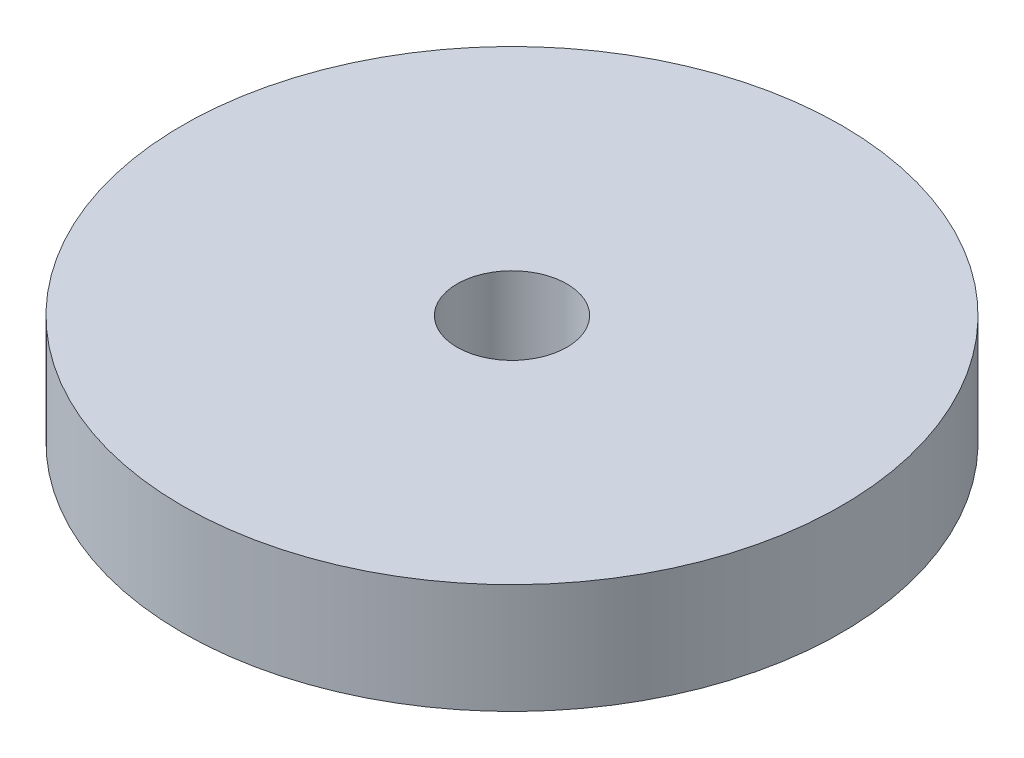
ISO-10303-21;
HEADER;
FILE_DESCRIPTION(('STEP AP214'),'2;1');
FILE_NAME('part.step','',(''),(''),'','','');
FILE_SCHEMA(('AUTOMOTIVE_DESIGN { 1 0 10303 214 1 1 1 1 }'));
ENDSEC;
DATA;
#1=APPLICATION_CONTEXT('core data for automotive mechanical design processes');
#2=APPLICATION_PROTOCOL_DEFINITION('international standard','automotive_design',2000,#1);
#3=PRODUCT_CONTEXT('',#1,'mechanical');
#4=PRODUCT('Part','Part','',(#3));
#5=PRODUCT_RELATED_PRODUCT_CATEGORY('part','',(#4));
#6=PRODUCT_DEFINITION_FORMATION('','',#4);
#7=PRODUCT_DEFINITION_CONTEXT('part definition',#1,'design');
#8=PRODUCT_DEFINITION('design','',#6,#7);
#9=PRODUCT_DEFINITION_SHAPE('','',#8);
#10=(LENGTH_UNIT() NAMED_UNIT(*) SI_UNIT(.MILLI.,.METRE.));
#11=(NAMED_UNIT(*) PLANE_ANGLE_UNIT() SI_UNIT($,.RADIAN.));
#12=(NAMED_UNIT(*) SI_UNIT($,.STERADIAN.) SOLID_ANGLE_UNIT());
#13=UNCERTAINTY_MEASURE_WITH_UNIT(LENGTH_MEASURE(1.E-05),#10,'distance_accuracy_value','');
#14=(GEOMETRIC_REPRESENTATION_CONTEXT(3) GLOBAL_UNCERTAINTY_ASSIGNED_CONTEXT((#13)) GLOBAL_UNIT_ASSIGNED_CONTEXT((#10,
#11,#12)) REPRESENTATION_CONTEXT('',''));
#15=CARTESIAN_POINT('',(0.,0.,0.));
#16=DIRECTION('',(0.,0.,1.));
#17=DIRECTION('',(1.,0.,0.));
#18=AXIS2_PLACEMENT_3D('',#15,#16,#17);
#19=CARTESIAN_POINT('',(0.,-25.,0.));
#20=DIRECTION('',(0.,1.,0.));
#21=DIRECTION('',(0.,0.,1.));
#22=AXIS2_PLACEMENT_3D('',#19,#20,#21);
#23=CYLINDRICAL_SURFACE('',#22,150.);
#24=CARTESIAN_POINT('',(0.,-25.,0.));
#25=DIRECTION('',(0.,1.,0.));
#26=DIRECTION('',(0.,0.,1.));
#27=AXIS2_PLACEMENT_3D('',#24,#25,#26);
#28=CIRCLE('',#27,150.);
#29=CARTESIAN_POINT('',(0.,-25.,150.));
#30=VERTEX_POINT('',#29);
#31=EDGE_CURVE('E10',#30,#30,#28,.T.);
#32=ORIENTED_EDGE('',*,*,#31,.T.);
#33=EDGE_LOOP('',(#32));
#34=FACE_BOUND('',#33,.T.);
#35=CARTESIAN_POINT('',(0.,25.,0.));
#36=DIRECTION('',(0.,1.,0.));
#37=DIRECTION('',(0.,0.,1.));
#38=AXIS2_PLACEMENT_3D('',#35,#36,#37);
#39=CIRCLE('',#38,150.);
#40=CARTESIAN_POINT('',(0.,25.,150.));
#41=VERTEX_POINT('',#40);
#42=EDGE_CURVE('E40',#41,#41,#39,.T.);
#43=ORIENTED_EDGE('',*,*,#42,.F.);
#44=EDGE_LOOP('',(#43));
#45=FACE_BOUND('',#44,.T.);
#46=ADVANCED_FACE('F34',(#34,#45),#23,.T.);
#47=CARTESIAN_POINT('',(0.,-25.,0.));
#48=DIRECTION('',(0.,1.,0.));
#49=DIRECTION('',(0.,0.,1.));
#50=AXIS2_PLACEMENT_3D('',#47,#48,#49);
#51=PLANE('',#50);
#52=CARTESIAN_POINT('',(0.,-25.,0.));
#53=DIRECTION('',(0.,1.,0.));
#54=DIRECTION('',(0.,0.,1.));
#55=AXIS2_PLACEMENT_3D('',#52,#53,#54);
#56=CIRCLE('',#55,25.);
#57=CARTESIAN_POINT('',(0.,-25.,25.));
#58=VERTEX_POINT('',#57);
#59=EDGE_CURVE('E44',#58,#58,#56,.T.);
#60=ORIENTED_EDGE('',*,*,#59,.T.);
#61=EDGE_LOOP('',(#60));
#62=FACE_BOUND('',#61,.T.);
#63=ORIENTED_EDGE('',*,*,#31,.F.);
#64=EDGE_LOOP('',(#63));
#65=FACE_BOUND('',#64,.T.);
#66=ADVANCED_FACE('F58',(#62,#65),#51,.F.);
#67=CARTESIAN_POINT('',(0.,25.,0.));
#68=DIRECTION('',(0.,1.,0.));
#69=DIRECTION('',(0.,0.,1.));
#70=AXIS2_PLACEMENT_3D('',#67,#68,#69);
#71=PLANE('',#70);
#72=CARTESIAN_POINT('',(0.,25.,0.));
#73=DIRECTION('',(0.,1.,0.));
#74=DIRECTION('',(0.,0.,1.));
#75=AXIS2_PLACEMENT_3D('',#72,#73,#74);
#76=CIRCLE('',#75,25.);
#77=CARTESIAN_POINT('',(0.,25.,25.));
#78=VERTEX_POINT('',#77);
#79=EDGE_CURVE('E48',#78,#78,#76,.T.);
#80=ORIENTED_EDGE('',*,*,#79,.F.);
#81=EDGE_LOOP('',(#80));
#82=FACE_BOUND('',#81,.T.);
#83=ORIENTED_EDGE('',*,*,#42,.T.);
#84=EDGE_LOOP('',(#83));
#85=FACE_BOUND('',#84,.T.);
#86=ADVANCED_FACE('F56',(#82,#85),#71,.T.);
#87=CARTESIAN_POINT('',(0.,-25.,0.));
#88=DIRECTION('',(0.,1.,0.));
#89=DIRECTION('',(0.,0.,1.));
#90=AXIS2_PLACEMENT_3D('',#87,#88,#89);
#91=CYLINDRICAL_SURFACE('',#90,25.);
#92=ORIENTED_EDGE('',*,*,#59,.F.);
#93=EDGE_LOOP('',(#92));
#94=FACE_BOUND('',#93,.T.);
#95=ORIENTED_EDGE('',*,*,#79,.T.);
#96=EDGE_LOOP('',(#95));
#97=FACE_BOUND('',#96,.T.);
#98=ADVANCED_FACE('F54',(#94,#97),#91,.F.);
#99=CLOSED_SHELL('',(#46,#66,#86,#98));
#100=MANIFOLD_SOLID_BREP('B2',#99);
#101=ADVANCED_BREP_SHAPE_REPRESENTATION('',(#18,#100),#14);
#102=SHAPE_DEFINITION_REPRESENTATION(#9,#101);
ENDSEC;
END-ISO-10303-21;
